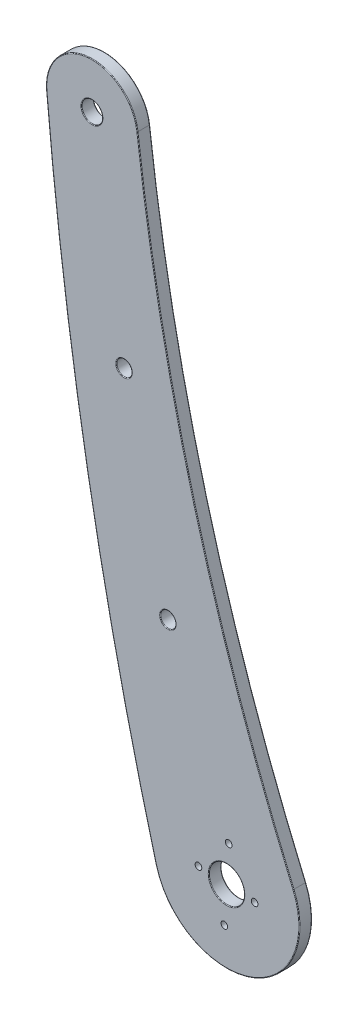
ISO-10303-21;
HEADER;
FILE_DESCRIPTION(('STEP AP214'),'2;1');
FILE_NAME('part.step','',(''),(''),'','','');
FILE_SCHEMA(('AUTOMOTIVE_DESIGN { 1 0 10303 214 1 1 1 1 }'));
ENDSEC;
DATA;
#1=APPLICATION_CONTEXT('core data for automotive mechanical design processes');
#2=APPLICATION_PROTOCOL_DEFINITION('international standard','automotive_design',2000,#1);
#3=PRODUCT_CONTEXT('',#1,'mechanical');
#4=PRODUCT('Part','Part','',(#3));
#5=PRODUCT_RELATED_PRODUCT_CATEGORY('part','',(#4));
#6=PRODUCT_DEFINITION_FORMATION('','',#4);
#7=PRODUCT_DEFINITION_CONTEXT('part definition',#1,'design');
#8=PRODUCT_DEFINITION('design','',#6,#7);
#9=PRODUCT_DEFINITION_SHAPE('','',#8);
#10=(LENGTH_UNIT() NAMED_UNIT(*) SI_UNIT(.MILLI.,.METRE.));
#11=(NAMED_UNIT(*) PLANE_ANGLE_UNIT() SI_UNIT($,.RADIAN.));
#12=(NAMED_UNIT(*) SI_UNIT($,.STERADIAN.) SOLID_ANGLE_UNIT());
#13=UNCERTAINTY_MEASURE_WITH_UNIT(LENGTH_MEASURE(1.E-05),#10,'distance_accuracy_value','');
#14=(GEOMETRIC_REPRESENTATION_CONTEXT(3) GLOBAL_UNCERTAINTY_ASSIGNED_CONTEXT((#13)) GLOBAL_UNIT_ASSIGNED_CONTEXT((#10,
#11,#12)) REPRESENTATION_CONTEXT('',''));
#15=CARTESIAN_POINT('',(0.,0.,0.));
#16=DIRECTION('',(0.,0.,1.));
#17=DIRECTION('',(1.,0.,0.));
#18=AXIS2_PLACEMENT_3D('',#15,#16,#17);
#19=CARTESIAN_POINT('',(-52.5326704764156,202.00953759165,-3.));
#20=DIRECTION('',(0.,0.,1.));
#21=DIRECTION('',(1.,0.,0.));
#22=AXIS2_PLACEMENT_3D('',#19,#20,#21);
#23=CYLINDRICAL_SURFACE('',#22,11.);
#24=DIRECTION('',(0.,0.,1.));
#25=VECTOR('',#24,1.);
#26=CARTESIAN_POINT('',(-63.4903311638689,201.045342456505,-3.));
#27=LINE('',#26,#25);
#28=CARTESIAN_POINT('',(-63.4903311638689,201.045342456505,-2.85));
#29=VERTEX_POINT('',#28);
#30=CARTESIAN_POINT('',(-63.4903311638689,201.045342456505,-0.15));
#31=VERTEX_POINT('',#30);
#32=EDGE_CURVE('E191',#29,#31,#27,.T.);
#33=ORIENTED_EDGE('',*,*,#32,.T.);
#34=CARTESIAN_POINT('',(-52.5326704764156,202.00953759165,-0.15));
#35=DIRECTION('',(0.,0.,-1.));
#36=DIRECTION('',(-1.,0.,0.));
#37=AXIS2_PLACEMENT_3D('',#34,#35,#36);
#38=CIRCLE('',#37,11.);
#39=CARTESIAN_POINT('',(-41.6108764018388,203.318893995591,-0.15));
#40=VERTEX_POINT('',#39);
#41=EDGE_CURVE('E144',#31,#40,#38,.T.);
#42=ORIENTED_EDGE('',*,*,#41,.T.);
#43=DIRECTION('',(0.,0.,1.));
#44=VECTOR('',#43,1.);
#45=CARTESIAN_POINT('',(-41.6108764018388,203.318893995591,-3.));
#46=LINE('',#45,#44);
#47=CARTESIAN_POINT('',(-41.6108764018388,203.318893995591,-2.85));
#48=VERTEX_POINT('',#47);
#49=EDGE_CURVE('E344',#48,#40,#46,.T.);
#50=ORIENTED_EDGE('',*,*,#49,.F.);
#51=CARTESIAN_POINT('',(-52.5326704764156,202.00953759165,-2.85));
#52=DIRECTION('',(0.,0.,-1.));
#53=DIRECTION('',(-1.,0.,0.));
#54=AXIS2_PLACEMENT_3D('',#51,#52,#53);
#55=CIRCLE('',#54,11.);
#56=EDGE_CURVE('E142',#48,#29,#55,.F.);
#57=ORIENTED_EDGE('',*,*,#56,.T.);
#58=EDGE_LOOP('',(#33,#42,#50,#57));
#59=FACE_BOUND('',#58,.T.);
#60=ADVANCED_FACE('F33',(#59),#23,.T.);
#61=CARTESIAN_POINT('',(454.834308806195,262.835094174707,-3.));
#62=DIRECTION('',(0.,0.,1.));
#63=DIRECTION('',(1.,0.,0.));
#64=AXIS2_PLACEMENT_3D('',#61,#62,#63);
#65=CYLINDRICAL_SURFACE('',#64,500.);
#66=ORIENTED_EDGE('',*,*,#49,.T.);
#67=CARTESIAN_POINT('',(454.834308806195,262.835094174707,-0.15));
#68=DIRECTION('',(0.,0.,-1.));
#69=DIRECTION('',(-1.,0.,0.));
#70=AXIS2_PLACEMENT_3D('',#67,#68,#69);
#71=CIRCLE('',#70,500.);
#72=CARTESIAN_POINT('',(-4.15536153795476,64.5209935228163,-0.15));
#73=VERTEX_POINT('',#72);
#74=EDGE_CURVE('E105',#40,#73,#71,.F.);
#75=ORIENTED_EDGE('',*,*,#74,.T.);
#76=DIRECTION('',(0.,0.,1.));
#77=VECTOR('',#76,1.);
#78=CARTESIAN_POINT('',(-4.15536153795476,64.5209935228163,-3.));
#79=LINE('',#78,#77);
#80=CARTESIAN_POINT('',(-4.15536153795476,64.5209935228163,-2.85));
#81=VERTEX_POINT('',#80);
#82=EDGE_CURVE('E338',#81,#73,#79,.T.);
#83=ORIENTED_EDGE('',*,*,#82,.F.);
#84=CARTESIAN_POINT('',(454.834308806195,262.835094174707,-2.85));
#85=DIRECTION('',(0.,0.,-1.));
#86=DIRECTION('',(-1.,0.,0.));
#87=AXIS2_PLACEMENT_3D('',#84,#85,#86);
#88=CIRCLE('',#87,500.);
#89=EDGE_CURVE('E126',#81,#48,#88,.T.);
#90=ORIENTED_EDGE('',*,*,#89,.T.);
#91=EDGE_LOOP('',(#66,#75,#83,#90));
#92=FACE_BOUND('',#91,.T.);
#93=ADVANCED_FACE('F228',(#92),#65,.F.);
#94=CARTESIAN_POINT('',(-20.22,57.58,-3.));
#95=DIRECTION('',(0.,0.,1.));
#96=DIRECTION('',(1.,0.,0.));
#97=AXIS2_PLACEMENT_3D('',#94,#95,#96);
#98=CYLINDRICAL_SURFACE('',#97,17.4999999999999);
#99=ORIENTED_EDGE('',*,*,#82,.T.);
#100=CARTESIAN_POINT('',(-20.22,57.58,-0.15));
#101=DIRECTION('',(0.,0.,-1.));
#102=DIRECTION('',(-1.,0.,0.));
#103=AXIS2_PLACEMENT_3D('',#100,#101,#102);
#104=CIRCLE('',#103,17.4999999999999);
#105=CARTESIAN_POINT('',(-37.1095073957766,52.9980200864687,-0.15));
#106=VERTEX_POINT('',#105);
#107=EDGE_CURVE('E135',#73,#106,#104,.T.);
#108=ORIENTED_EDGE('',*,*,#107,.T.);
#109=DIRECTION('',(0.,0.,1.));
#110=VECTOR('',#109,1.);
#111=CARTESIAN_POINT('',(-37.1095073957766,52.9980200864687,-3.));
#112=LINE('',#111,#110);
#113=CARTESIAN_POINT('',(-37.1095073957766,52.9980200864687,-2.85));
#114=VERTEX_POINT('',#113);
#115=EDGE_CURVE('E345',#114,#106,#112,.T.);
#116=ORIENTED_EDGE('',*,*,#115,.F.);
#117=CARTESIAN_POINT('',(-20.22,57.58,-2.85));
#118=DIRECTION('',(0.,0.,-1.));
#119=DIRECTION('',(-1.,0.,0.));
#120=AXIS2_PLACEMENT_3D('',#117,#118,#119);
#121=CIRCLE('',#120,17.4999999999999);
#122=EDGE_CURVE('E133',#114,#81,#121,.F.);
#123=ORIENTED_EDGE('',*,*,#122,.T.);
#124=EDGE_LOOP('',(#99,#108,#116,#123));
#125=FACE_BOUND('',#124,.T.);
#126=ADVANCED_FACE('F234',(#125),#98,.T.);
#127=CARTESIAN_POINT('',(783.237994684804,275.551330172281,-3.));
#128=DIRECTION('',(0.,0.,1.));
#129=DIRECTION('',(1.,0.,0.));
#130=AXIS2_PLACEMENT_3D('',#127,#128,#129);
#131=CYLINDRICAL_SURFACE('',#130,850.);
#132=ORIENTED_EDGE('',*,*,#115,.T.);
#133=CARTESIAN_POINT('',(783.237994684804,275.551330172281,-0.15));
#134=DIRECTION('',(0.,0.,-1.));
#135=DIRECTION('',(-1.,0.,0.));
#136=AXIS2_PLACEMENT_3D('',#133,#134,#135);
#137=CIRCLE('',#136,850.);
#138=EDGE_CURVE('E140',#106,#31,#137,.T.);
#139=ORIENTED_EDGE('',*,*,#138,.T.);
#140=ORIENTED_EDGE('',*,*,#32,.F.);
#141=CARTESIAN_POINT('',(783.237994684804,275.551330172281,-2.85));
#142=DIRECTION('',(0.,0.,-1.));
#143=DIRECTION('',(-1.,0.,0.));
#144=AXIS2_PLACEMENT_3D('',#141,#142,#143);
#145=CIRCLE('',#144,850.);
#146=EDGE_CURVE('E137',#29,#114,#145,.F.);
#147=ORIENTED_EDGE('',*,*,#146,.T.);
#148=EDGE_LOOP('',(#132,#139,#140,#147));
#149=FACE_BOUND('',#148,.T.);
#150=ADVANCED_FACE('F240',(#149),#131,.T.);
#151=CARTESIAN_POINT('',(201.15081916489,232.422315883179,-3.));
#152=DIRECTION('',(0.,0.,-1.));
#153=DIRECTION('',(-1.,0.,0.));
#154=AXIS2_PLACEMENT_3D('',#151,#152,#153);
#155=PLANE('',#154);
#156=CARTESIAN_POINT('',(-26.9578565541103,57.9847086064185,-3.));
#157=DIRECTION('',(0.,0.,-1.));
#158=DIRECTION('',(-1.,0.,0.));
#159=AXIS2_PLACEMENT_3D('',#156,#157,#158);
#160=CIRCLE('',#159,0.799999999990664);
#161=CARTESIAN_POINT('',(-27.7578565541009,57.9847086064185,-3.));
#162=VERTEX_POINT('',#161);
#163=EDGE_CURVE('E205',#162,#162,#160,.T.);
#164=ORIENTED_EDGE('',*,*,#163,.F.);
#165=EDGE_LOOP('',(#164));
#166=FACE_BOUND('',#165,.T.);
#167=CARTESIAN_POINT('',(-20.7446222675799,48.8457415039233,-3.));
#168=DIRECTION('',(0.,0.,-1.));
#169=DIRECTION('',(-1.,0.,0.));
#170=AXIS2_PLACEMENT_3D('',#167,#168,#169);
#171=CIRCLE('',#170,0.800000000000003);
#172=CARTESIAN_POINT('',(-21.5446222675799,48.8457415039233,-3.));
#173=VERTEX_POINT('',#172);
#174=EDGE_CURVE('E408',#173,#173,#171,.T.);
#175=ORIENTED_EDGE('',*,*,#174,.F.);
#176=EDGE_LOOP('',(#175));
#177=FACE_BOUND('',#176,.T.);
#178=CARTESIAN_POINT('',(-13.4821434458898,57.1752913935817,-3.));
#179=DIRECTION('',(0.,0.,-1.));
#180=DIRECTION('',(1.,0.,0.));
#181=AXIS2_PLACEMENT_3D('',#178,#179,#180);
#182=CIRCLE('',#181,0.799999999990663);
#183=CARTESIAN_POINT('',(-12.6821434458991,57.1752913935817,-3.));
#184=VERTEX_POINT('',#183);
#185=EDGE_CURVE('E405',#184,#184,#182,.T.);
#186=ORIENTED_EDGE('',*,*,#185,.F.);
#187=EDGE_LOOP('',(#186));
#188=FACE_BOUND('',#187,.T.);
#189=CARTESIAN_POINT('',(-19.6953777324201,66.3142584960768,-3.));
#190=DIRECTION('',(0.,0.,-1.));
#191=DIRECTION('',(1.,0.,0.));
#192=AXIS2_PLACEMENT_3D('',#189,#190,#191);
#193=CIRCLE('',#192,0.800000000000005);
#194=CARTESIAN_POINT('',(-18.8953777324201,66.3142584960768,-3.));
#195=VERTEX_POINT('',#194);
#196=EDGE_CURVE('E402',#195,#195,#193,.T.);
#197=ORIENTED_EDGE('',*,*,#196,.F.);
#198=EDGE_LOOP('',(#197));
#199=FACE_BOUND('',#198,.T.);
#200=CARTESIAN_POINT('',(-20.22,57.58,-3.));
#201=DIRECTION('',(0.,0.,-1.));
#202=DIRECTION('',(-1.,0.,0.));
#203=AXIS2_PLACEMENT_3D('',#200,#201,#202);
#204=CIRCLE('',#203,17.3499999999999);
#205=CARTESIAN_POINT('',(-4.29305843905803,64.4614992926207,-3.));
#206=VERTEX_POINT('',#205);
#207=CARTESIAN_POINT('',(-36.9647401895271,53.0372942000132,-3.));
#208=VERTEX_POINT('',#207);
#209=EDGE_CURVE('E42',#206,#208,#204,.T.);
#210=ORIENTED_EDGE('',*,*,#209,.T.);
#211=CARTESIAN_POINT('',(783.237994684804,275.551330172281,-3.));
#212=DIRECTION('',(0.,0.,-1.));
#213=DIRECTION('',(-1.,0.,0.));
#214=AXIS2_PLACEMENT_3D('',#211,#212,#213);
#215=CIRCLE('',#214,849.85);
#216=CARTESIAN_POINT('',(-63.340908518131,201.058490571985,-3.));
#217=VERTEX_POINT('',#216);
#218=EDGE_CURVE('E11',#208,#217,#215,.T.);
#219=ORIENTED_EDGE('',*,*,#218,.T.);
#220=CARTESIAN_POINT('',(-52.5326704764156,202.00953759165,-3.));
#221=DIRECTION('',(0.,0.,-1.));
#222=DIRECTION('',(-1.,0.,0.));
#223=AXIS2_PLACEMENT_3D('',#220,#221,#222);
#224=CIRCLE('',#223,10.85);
#225=CARTESIAN_POINT('',(-41.7598099574013,203.301039135537,-3.));
#226=VERTEX_POINT('',#225);
#227=EDGE_CURVE('E182',#217,#226,#224,.T.);
#228=ORIENTED_EDGE('',*,*,#227,.T.);
#229=CARTESIAN_POINT('',(454.834308806195,262.835094174707,-3.));
#230=DIRECTION('',(0.,0.,-1.));
#231=DIRECTION('',(-1.,0.,0.));
#232=AXIS2_PLACEMENT_3D('',#229,#230,#231);
#233=CIRCLE('',#232,500.15);
#234=EDGE_CURVE('E53',#226,#206,#233,.F.);
#235=ORIENTED_EDGE('',*,*,#234,.T.);
#236=EDGE_LOOP('',(#210,#219,#228,#235));
#237=FACE_BOUND('',#236,.T.);
#238=CARTESIAN_POINT('',(-52.5326704764156,202.00953759165,-3.));
#239=DIRECTION('',(0.,0.,-1.));
#240=DIRECTION('',(-1.,0.,0.));
#241=AXIS2_PLACEMENT_3D('',#238,#239,#240);
#242=CIRCLE('',#241,2.65);
#243=CARTESIAN_POINT('',(-55.1826704764156,202.00953759165,-3.));
#244=VERTEX_POINT('',#243);
#245=EDGE_CURVE('E179',#244,#244,#242,.F.);
#246=ORIENTED_EDGE('',*,*,#245,.T.);
#247=EDGE_LOOP('',(#246));
#248=FACE_BOUND('',#247,.T.);
#249=CARTESIAN_POINT('',(-20.22,57.5800000000001,-3.));
#250=DIRECTION('',(0.,0.,-1.));
#251=DIRECTION('',(-1.,0.,0.));
#252=AXIS2_PLACEMENT_3D('',#249,#250,#251);
#253=CIRCLE('',#252,4.4);
#254=CARTESIAN_POINT('',(-24.62,57.5800000000001,-3.));
#255=VERTEX_POINT('',#254);
#256=EDGE_CURVE('E176',#255,#255,#253,.F.);
#257=ORIENTED_EDGE('',*,*,#256,.T.);
#258=EDGE_LOOP('',(#257));
#259=FACE_BOUND('',#258,.T.);
#260=CARTESIAN_POINT('',(-34.3061626122095,105.554785282088,-3.));
#261=DIRECTION('',(0.,0.,-1.));
#262=DIRECTION('',(-1.,0.,0.));
#263=AXIS2_PLACEMENT_3D('',#260,#261,#262);
#264=CIRCLE('',#263,1.99999999999999);
#265=CARTESIAN_POINT('',(-36.3061626122095,105.554785282088,-3.));
#266=VERTEX_POINT('',#265);
#267=EDGE_CURVE('E173',#266,#266,#264,.F.);
#268=ORIENTED_EDGE('',*,*,#267,.T.);
#269=EDGE_LOOP('',(#268));
#270=FACE_BOUND('',#269,.T.);
#271=CARTESIAN_POINT('',(-44.8327479429161,152.605983134728,-3.));
#272=DIRECTION('',(0.,0.,-1.));
#273=DIRECTION('',(-1.,0.,0.));
#274=AXIS2_PLACEMENT_3D('',#271,#272,#273);
#275=CIRCLE('',#274,1.99999999999999);
#276=CARTESIAN_POINT('',(-46.8327479429161,152.605983134728,-3.));
#277=VERTEX_POINT('',#276);
#278=EDGE_CURVE('E170',#277,#277,#275,.F.);
#279=ORIENTED_EDGE('',*,*,#278,.T.);
#280=EDGE_LOOP('',(#279));
#281=FACE_BOUND('',#280,.T.);
#282=ADVANCED_FACE('F325',(#166,#177,#188,#199,#237,#248,#259,#270,#281),#155,.T.);
#283=CARTESIAN_POINT('',(201.15081916489,232.422315883179,0.));
#284=DIRECTION('',(0.,0.,-1.));
#285=DIRECTION('',(-1.,0.,0.));
#286=AXIS2_PLACEMENT_3D('',#283,#284,#285);
#287=PLANE('',#286);
#288=CARTESIAN_POINT('',(-26.9578565541103,57.9847086064185,0.));
#289=DIRECTION('',(0.,0.,-1.));
#290=DIRECTION('',(-1.,0.,0.));
#291=AXIS2_PLACEMENT_3D('',#288,#289,#290);
#292=CIRCLE('',#291,0.799999999990664);
#293=CARTESIAN_POINT('',(-27.7578565541009,57.9847086064185,0.));
#294=VERTEX_POINT('',#293);
#295=EDGE_CURVE('E37',#294,#294,#292,.T.);
#296=ORIENTED_EDGE('',*,*,#295,.T.);
#297=EDGE_LOOP('',(#296));
#298=FACE_BOUND('',#297,.T.);
#299=CARTESIAN_POINT('',(-20.7446222675799,48.8457415039233,0.));
#300=DIRECTION('',(0.,0.,-1.));
#301=DIRECTION('',(-1.,0.,0.));
#302=AXIS2_PLACEMENT_3D('',#299,#300,#301);
#303=CIRCLE('',#302,0.800000000000003);
#304=CARTESIAN_POINT('',(-21.5446222675799,48.8457415039233,0.));
#305=VERTEX_POINT('',#304);
#306=EDGE_CURVE('E207',#305,#305,#303,.T.);
#307=ORIENTED_EDGE('',*,*,#306,.T.);
#308=EDGE_LOOP('',(#307));
#309=FACE_BOUND('',#308,.T.);
#310=CARTESIAN_POINT('',(-13.4821434458898,57.1752913935817,0.));
#311=DIRECTION('',(0.,0.,-1.));
#312=DIRECTION('',(-1.,0.,0.));
#313=AXIS2_PLACEMENT_3D('',#310,#311,#312);
#314=CIRCLE('',#313,0.799999999990663);
#315=CARTESIAN_POINT('',(-14.2821434458804,57.1752913935817,0.));
#316=VERTEX_POINT('',#315);
#317=EDGE_CURVE('E204',#316,#316,#314,.T.);
#318=ORIENTED_EDGE('',*,*,#317,.T.);
#319=EDGE_LOOP('',(#318));
#320=FACE_BOUND('',#319,.T.);
#321=CARTESIAN_POINT('',(-19.6953777324201,66.3142584960768,0.));
#322=DIRECTION('',(0.,0.,-1.));
#323=DIRECTION('',(-1.,0.,0.));
#324=AXIS2_PLACEMENT_3D('',#321,#322,#323);
#325=CIRCLE('',#324,0.800000000000005);
#326=CARTESIAN_POINT('',(-20.4953777324201,66.3142584960768,0.));
#327=VERTEX_POINT('',#326);
#328=EDGE_CURVE('E201',#327,#327,#325,.T.);
#329=ORIENTED_EDGE('',*,*,#328,.T.);
#330=EDGE_LOOP('',(#329));
#331=FACE_BOUND('',#330,.T.);
#332=CARTESIAN_POINT('',(-20.22,57.58,0.));
#333=DIRECTION('',(0.,0.,-1.));
#334=DIRECTION('',(-1.,0.,0.));
#335=AXIS2_PLACEMENT_3D('',#332,#333,#334);
#336=CIRCLE('',#335,17.3499999999999);
#337=CARTESIAN_POINT('',(-36.964740189527,53.0372942000132,0.));
#338=VERTEX_POINT('',#337);
#339=CARTESIAN_POINT('',(-4.29305843905814,64.4614992926207,0.));
#340=VERTEX_POINT('',#339);
#341=EDGE_CURVE('E124',#338,#340,#336,.F.);
#342=ORIENTED_EDGE('',*,*,#341,.T.);
#343=CARTESIAN_POINT('',(454.834308806195,262.835094174707,0.));
#344=DIRECTION('',(0.,0.,-1.));
#345=DIRECTION('',(-1.,0.,0.));
#346=AXIS2_PLACEMENT_3D('',#343,#344,#345);
#347=CIRCLE('',#346,500.15);
#348=CARTESIAN_POINT('',(-41.7598099574013,203.301039135537,0.));
#349=VERTEX_POINT('',#348);
#350=EDGE_CURVE('E103',#340,#349,#347,.T.);
#351=ORIENTED_EDGE('',*,*,#350,.T.);
#352=CARTESIAN_POINT('',(-52.5326704764156,202.00953759165,0.));
#353=DIRECTION('',(0.,0.,-1.));
#354=DIRECTION('',(-1.,0.,0.));
#355=AXIS2_PLACEMENT_3D('',#352,#353,#354);
#356=CIRCLE('',#355,10.85);
#357=CARTESIAN_POINT('',(-63.340908518131,201.058490571985,0.));
#358=VERTEX_POINT('',#357);
#359=EDGE_CURVE('E112',#349,#358,#356,.F.);
#360=ORIENTED_EDGE('',*,*,#359,.T.);
#361=CARTESIAN_POINT('',(783.237994684804,275.551330172281,0.));
#362=DIRECTION('',(0.,0.,-1.));
#363=DIRECTION('',(-1.,0.,0.));
#364=AXIS2_PLACEMENT_3D('',#361,#362,#363);
#365=CIRCLE('',#364,849.85);
#366=EDGE_CURVE('E118',#358,#338,#365,.F.);
#367=ORIENTED_EDGE('',*,*,#366,.T.);
#368=EDGE_LOOP('',(#342,#351,#360,#367));
#369=FACE_BOUND('',#368,.T.);
#370=CARTESIAN_POINT('',(-52.5326704764156,202.00953759165,0.));
#371=DIRECTION('',(0.,0.,-1.));
#372=DIRECTION('',(-1.,0.,0.));
#373=AXIS2_PLACEMENT_3D('',#370,#371,#372);
#374=CIRCLE('',#373,2.65);
#375=CARTESIAN_POINT('',(-55.1826704764156,202.00953759165,0.));
#376=VERTEX_POINT('',#375);
#377=EDGE_CURVE('E119',#376,#376,#374,.T.);
#378=ORIENTED_EDGE('',*,*,#377,.T.);
#379=EDGE_LOOP('',(#378));
#380=FACE_BOUND('',#379,.T.);
#381=CARTESIAN_POINT('',(-20.22,57.5800000000001,0.));
#382=DIRECTION('',(0.,0.,-1.));
#383=DIRECTION('',(-1.,0.,0.));
#384=AXIS2_PLACEMENT_3D('',#381,#382,#383);
#385=CIRCLE('',#384,4.4);
#386=CARTESIAN_POINT('',(-24.62,57.5800000000001,0.));
#387=VERTEX_POINT('',#386);
#388=EDGE_CURVE('E359',#387,#387,#385,.T.);
#389=ORIENTED_EDGE('',*,*,#388,.T.);
#390=EDGE_LOOP('',(#389));
#391=FACE_BOUND('',#390,.T.);
#392=CARTESIAN_POINT('',(-34.3061626122095,105.554785282088,0.));
#393=DIRECTION('',(0.,0.,-1.));
#394=DIRECTION('',(-1.,0.,0.));
#395=AXIS2_PLACEMENT_3D('',#392,#393,#394);
#396=CIRCLE('',#395,1.99999999999999);
#397=CARTESIAN_POINT('',(-36.3061626122095,105.554785282088,0.));
#398=VERTEX_POINT('',#397);
#399=EDGE_CURVE('E356',#398,#398,#396,.T.);
#400=ORIENTED_EDGE('',*,*,#399,.T.);
#401=EDGE_LOOP('',(#400));
#402=FACE_BOUND('',#401,.T.);
#403=CARTESIAN_POINT('',(-44.8327479429161,152.605983134728,0.));
#404=DIRECTION('',(0.,0.,-1.));
#405=DIRECTION('',(-1.,0.,0.));
#406=AXIS2_PLACEMENT_3D('',#403,#404,#405);
#407=CIRCLE('',#406,1.99999999999999);
#408=CARTESIAN_POINT('',(-46.8327479429161,152.605983134728,0.));
#409=VERTEX_POINT('',#408);
#410=EDGE_CURVE('E348',#409,#409,#407,.T.);
#411=ORIENTED_EDGE('',*,*,#410,.T.);
#412=EDGE_LOOP('',(#411));
#413=FACE_BOUND('',#412,.T.);
#414=ADVANCED_FACE('F121',(#298,#309,#320,#331,#369,#380,#391,#402,#413),#287,.F.);
#415=CARTESIAN_POINT('',(-52.5326704764156,202.00953759165,-3.));
#416=DIRECTION('',(0.,0.,1.));
#417=DIRECTION('',(1.,0.,0.));
#418=AXIS2_PLACEMENT_3D('',#415,#416,#417);
#419=CYLINDRICAL_SURFACE('',#418,2.5);
#420=CARTESIAN_POINT('',(-52.5326704764156,202.00953759165,-0.15));
#421=DIRECTION('',(0.,0.,-1.));
#422=DIRECTION('',(-1.,0.,0.));
#423=AXIS2_PLACEMENT_3D('',#420,#421,#422);
#424=CIRCLE('',#423,2.5);
#425=CARTESIAN_POINT('',(-55.0326704764156,202.00953759165,-0.15));
#426=VERTEX_POINT('',#425);
#427=EDGE_CURVE('E149',#426,#426,#424,.F.);
#428=ORIENTED_EDGE('',*,*,#427,.T.);
#429=EDGE_LOOP('',(#428));
#430=FACE_BOUND('',#429,.T.);
#431=CARTESIAN_POINT('',(-52.5326704764156,202.00953759165,-2.85));
#432=DIRECTION('',(0.,0.,-1.));
#433=DIRECTION('',(-1.,0.,0.));
#434=AXIS2_PLACEMENT_3D('',#431,#432,#433);
#435=CIRCLE('',#434,2.5);
#436=CARTESIAN_POINT('',(-55.0326704764156,202.00953759165,-2.85));
#437=VERTEX_POINT('',#436);
#438=EDGE_CURVE('E146',#437,#437,#435,.T.);
#439=ORIENTED_EDGE('',*,*,#438,.T.);
#440=EDGE_LOOP('',(#439));
#441=FACE_BOUND('',#440,.T.);
#442=ADVANCED_FACE('F317',(#430,#441),#419,.F.);
#443=CARTESIAN_POINT('',(-20.22,57.5800000000001,-3.));
#444=DIRECTION('',(0.,0.,1.));
#445=DIRECTION('',(1.,0.,0.));
#446=AXIS2_PLACEMENT_3D('',#443,#444,#445);
#447=CYLINDRICAL_SURFACE('',#446,4.25);
#448=CARTESIAN_POINT('',(-20.22,57.5800000000001,-0.15));
#449=DIRECTION('',(0.,0.,-1.));
#450=DIRECTION('',(-1.,0.,0.));
#451=AXIS2_PLACEMENT_3D('',#448,#449,#450);
#452=CIRCLE('',#451,4.25);
#453=CARTESIAN_POINT('',(-24.47,57.5800000000001,-0.15));
#454=VERTEX_POINT('',#453);
#455=EDGE_CURVE('E155',#454,#454,#452,.F.);
#456=ORIENTED_EDGE('',*,*,#455,.T.);
#457=EDGE_LOOP('',(#456));
#458=FACE_BOUND('',#457,.T.);
#459=CARTESIAN_POINT('',(-20.22,57.5800000000001,-2.85));
#460=DIRECTION('',(0.,0.,-1.));
#461=DIRECTION('',(-1.,0.,0.));
#462=AXIS2_PLACEMENT_3D('',#459,#460,#461);
#463=CIRCLE('',#462,4.25);
#464=CARTESIAN_POINT('',(-24.47,57.5800000000001,-2.85));
#465=VERTEX_POINT('',#464);
#466=EDGE_CURVE('E152',#465,#465,#463,.T.);
#467=ORIENTED_EDGE('',*,*,#466,.T.);
#468=EDGE_LOOP('',(#467));
#469=FACE_BOUND('',#468,.T.);
#470=ADVANCED_FACE('F308',(#458,#469),#447,.F.);
#471=CARTESIAN_POINT('',(-34.3061626122095,105.554785282088,-3.));
#472=DIRECTION('',(0.,0.,-1.));
#473=DIRECTION('',(-1.,0.,0.));
#474=AXIS2_PLACEMENT_3D('',#471,#472,#473);
#475=CYLINDRICAL_SURFACE('',#474,1.84999999999999);
#476=CARTESIAN_POINT('',(-34.3061626122095,105.554785282088,-0.15));
#477=DIRECTION('',(0.,0.,-1.));
#478=DIRECTION('',(-1.,0.,0.));
#479=AXIS2_PLACEMENT_3D('',#476,#477,#478);
#480=CIRCLE('',#479,1.84999999999999);
#481=CARTESIAN_POINT('',(-36.1561626122095,105.554785282088,-0.15));
#482=VERTEX_POINT('',#481);
#483=EDGE_CURVE('E161',#482,#482,#480,.F.);
#484=ORIENTED_EDGE('',*,*,#483,.T.);
#485=EDGE_LOOP('',(#484));
#486=FACE_BOUND('',#485,.T.);
#487=CARTESIAN_POINT('',(-34.3061626122095,105.554785282088,-2.85));
#488=DIRECTION('',(0.,0.,-1.));
#489=DIRECTION('',(-1.,0.,0.));
#490=AXIS2_PLACEMENT_3D('',#487,#488,#489);
#491=CIRCLE('',#490,1.84999999999999);
#492=CARTESIAN_POINT('',(-36.1561626122095,105.554785282088,-2.85));
#493=VERTEX_POINT('',#492);
#494=EDGE_CURVE('E158',#493,#493,#491,.T.);
#495=ORIENTED_EDGE('',*,*,#494,.T.);
#496=EDGE_LOOP('',(#495));
#497=FACE_BOUND('',#496,.T.);
#498=ADVANCED_FACE('F306',(#486,#497),#475,.F.);
#499=CARTESIAN_POINT('',(-44.8327479429161,152.605983134728,-3.));
#500=DIRECTION('',(0.,0.,-1.));
#501=DIRECTION('',(-1.,0.,0.));
#502=AXIS2_PLACEMENT_3D('',#499,#500,#501);
#503=CYLINDRICAL_SURFACE('',#502,1.84999999999999);
#504=CARTESIAN_POINT('',(-44.8327479429161,152.605983134728,-0.15));
#505=DIRECTION('',(0.,0.,-1.));
#506=DIRECTION('',(-1.,0.,0.));
#507=AXIS2_PLACEMENT_3D('',#504,#505,#506);
#508=CIRCLE('',#507,1.84999999999999);
#509=CARTESIAN_POINT('',(-46.6827479429161,152.605983134728,-0.15));
#510=VERTEX_POINT('',#509);
#511=EDGE_CURVE('E167',#510,#510,#508,.F.);
#512=ORIENTED_EDGE('',*,*,#511,.T.);
#513=EDGE_LOOP('',(#512));
#514=FACE_BOUND('',#513,.T.);
#515=CARTESIAN_POINT('',(-44.8327479429161,152.605983134728,-2.85));
#516=DIRECTION('',(0.,0.,-1.));
#517=DIRECTION('',(-1.,0.,0.));
#518=AXIS2_PLACEMENT_3D('',#515,#516,#517);
#519=CIRCLE('',#518,1.84999999999999);
#520=CARTESIAN_POINT('',(-46.6827479429161,152.605983134728,-2.85));
#521=VERTEX_POINT('',#520);
#522=EDGE_CURVE('E164',#521,#521,#519,.T.);
#523=ORIENTED_EDGE('',*,*,#522,.T.);
#524=EDGE_LOOP('',(#523));
#525=FACE_BOUND('',#524,.T.);
#526=ADVANCED_FACE('F254',(#514,#525),#503,.F.);
#527=CARTESIAN_POINT('',(783.237994684804,275.551330172281,-0.15));
#528=DIRECTION('',(0.,0.,-1.));
#529=DIRECTION('',(-1.,0.,0.));
#530=AXIS2_PLACEMENT_3D('',#527,#528,#529);
#531=TOROIDAL_SURFACE('',#530,849.85,0.15);
#532=CARTESIAN_POINT('',(-63.3409085181309,201.058490571985,-0.15));
#533=DIRECTION('',(-0.0876541031950377,0.996150971586674,0.));
#534=DIRECTION('',(-0.996150971586674,-0.0876541031950377,0.));
#535=AXIS2_PLACEMENT_3D('',#532,#533,#534);
#536=CIRCLE('',#535,0.15);
#537=EDGE_CURVE('E115',#31,#358,#536,.T.);
#538=ORIENTED_EDGE('',*,*,#537,.F.);
#539=ORIENTED_EDGE('',*,*,#138,.F.);
#540=CARTESIAN_POINT('',(-36.964740189527,53.0372942000132,-0.15));
#541=DIRECTION('',(0.261827423630364,-0.965114708330096,0.));
#542=DIRECTION('',(0.965114708330096,0.261827423630364,0.));
#543=AXIS2_PLACEMENT_3D('',#540,#541,#542);
#544=CIRCLE('',#543,0.15);
#545=EDGE_CURVE('E188',#338,#106,#544,.T.);
#546=ORIENTED_EDGE('',*,*,#545,.F.);
#547=ORIENTED_EDGE('',*,*,#366,.F.);
#548=EDGE_LOOP('',(#538,#539,#546,#547));
#549=FACE_BOUND('',#548,.T.);
#550=ADVANCED_FACE('F250',(#549),#531,.T.);
#551=CARTESIAN_POINT('',(-20.22,57.58,-0.15));
#552=DIRECTION('',(0.,0.,-1.));
#553=DIRECTION('',(-1.,0.,0.));
#554=AXIS2_PLACEMENT_3D('',#551,#552,#553);
#555=TOROIDAL_SURFACE('',#554,17.3499999999999,0.15);
#556=ORIENTED_EDGE('',*,*,#545,.T.);
#557=ORIENTED_EDGE('',*,*,#107,.F.);
#558=CARTESIAN_POINT('',(-4.29305843905814,64.4614992926207,-0.15));
#559=DIRECTION('',(-0.396628201303757,0.917979340688311,0.));
#560=DIRECTION('',(-0.917979340688311,-0.396628201303757,0.));
#561=AXIS2_PLACEMENT_3D('',#558,#559,#560);
#562=CIRCLE('',#561,0.15);
#563=EDGE_CURVE('E108',#340,#73,#562,.T.);
#564=ORIENTED_EDGE('',*,*,#563,.F.);
#565=ORIENTED_EDGE('',*,*,#341,.F.);
#566=EDGE_LOOP('',(#556,#557,#564,#565));
#567=FACE_BOUND('',#566,.T.);
#568=ADVANCED_FACE('F247',(#567),#555,.T.);
#569=CARTESIAN_POINT('',(-52.5326704764156,202.00953759165,-0.15));
#570=DIRECTION('',(0.,0.,-1.));
#571=DIRECTION('',(-1.,0.,0.));
#572=AXIS2_PLACEMENT_3D('',#569,#570,#571);
#573=TOROIDAL_SURFACE('',#572,10.85,0.15);
#574=ORIENTED_EDGE('',*,*,#537,.T.);
#575=ORIENTED_EDGE('',*,*,#359,.F.);
#576=CARTESIAN_POINT('',(-41.7598099574013,203.301039135537,-0.15));
#577=DIRECTION('',(0.119032400358227,-0.992890370416069,0.));
#578=DIRECTION('',(0.992890370416069,0.119032400358227,0.));
#579=AXIS2_PLACEMENT_3D('',#576,#577,#578);
#580=CIRCLE('',#579,0.15);
#581=EDGE_CURVE('E99',#40,#349,#580,.T.);
#582=ORIENTED_EDGE('',*,*,#581,.F.);
#583=ORIENTED_EDGE('',*,*,#41,.F.);
#584=EDGE_LOOP('',(#574,#575,#582,#583));
#585=FACE_BOUND('',#584,.T.);
#586=ADVANCED_FACE('F113',(#585),#573,.T.);
#587=CARTESIAN_POINT('',(454.834308806195,262.835094174707,-0.15));
#588=DIRECTION('',(0.,0.,-1.));
#589=DIRECTION('',(-1.,0.,0.));
#590=AXIS2_PLACEMENT_3D('',#587,#588,#589);
#591=TOROIDAL_SURFACE('',#590,500.15,0.15);
#592=ORIENTED_EDGE('',*,*,#563,.T.);
#593=ORIENTED_EDGE('',*,*,#74,.F.);
#594=ORIENTED_EDGE('',*,*,#581,.T.);
#595=ORIENTED_EDGE('',*,*,#350,.F.);
#596=EDGE_LOOP('',(#592,#593,#594,#595));
#597=FACE_BOUND('',#596,.T.);
#598=ADVANCED_FACE('F101',(#597),#591,.T.);
#599=CARTESIAN_POINT('',(-52.5326704764156,202.00953759165,-0.15));
#600=DIRECTION('',(0.,0.,-1.));
#601=DIRECTION('',(-1.,0.,0.));
#602=AXIS2_PLACEMENT_3D('',#599,#600,#601);
#603=TOROIDAL_SURFACE('',#602,2.65,0.15);
#604=ORIENTED_EDGE('',*,*,#377,.F.);
#605=EDGE_LOOP('',(#604));
#606=FACE_BOUND('',#605,.T.);
#607=ORIENTED_EDGE('',*,*,#427,.F.);
#608=EDGE_LOOP('',(#607));
#609=FACE_BOUND('',#608,.T.);
#610=ADVANCED_FACE('F244',(#606,#609),#603,.T.);
#611=CARTESIAN_POINT('',(-20.22,57.5800000000001,-0.15));
#612=DIRECTION('',(0.,0.,-1.));
#613=DIRECTION('',(-1.,0.,0.));
#614=AXIS2_PLACEMENT_3D('',#611,#612,#613);
#615=TOROIDAL_SURFACE('',#614,4.4,0.15);
#616=ORIENTED_EDGE('',*,*,#388,.F.);
#617=EDGE_LOOP('',(#616));
#618=FACE_BOUND('',#617,.T.);
#619=ORIENTED_EDGE('',*,*,#455,.F.);
#620=EDGE_LOOP('',(#619));
#621=FACE_BOUND('',#620,.T.);
#622=ADVANCED_FACE('F258',(#618,#621),#615,.T.);
#623=CARTESIAN_POINT('',(-34.3061626122095,105.554785282088,-0.15));
#624=DIRECTION('',(0.,0.,-1.));
#625=DIRECTION('',(-1.,0.,0.));
#626=AXIS2_PLACEMENT_3D('',#623,#624,#625);
#627=TOROIDAL_SURFACE('',#626,1.99999999999999,0.15);
#628=ORIENTED_EDGE('',*,*,#483,.F.);
#629=EDGE_LOOP('',(#628));
#630=FACE_BOUND('',#629,.T.);
#631=ORIENTED_EDGE('',*,*,#399,.F.);
#632=EDGE_LOOP('',(#631));
#633=FACE_BOUND('',#632,.T.);
#634=ADVANCED_FACE('F262',(#630,#633),#627,.T.);
#635=CARTESIAN_POINT('',(-44.8327479429161,152.605983134728,-0.15));
#636=DIRECTION('',(0.,0.,-1.));
#637=DIRECTION('',(-1.,0.,0.));
#638=AXIS2_PLACEMENT_3D('',#635,#636,#637);
#639=TOROIDAL_SURFACE('',#638,1.99999999999999,0.15);
#640=ORIENTED_EDGE('',*,*,#511,.F.);
#641=EDGE_LOOP('',(#640));
#642=FACE_BOUND('',#641,.T.);
#643=ORIENTED_EDGE('',*,*,#410,.F.);
#644=EDGE_LOOP('',(#643));
#645=FACE_BOUND('',#644,.T.);
#646=ADVANCED_FACE('F266',(#642,#645),#639,.T.);
#647=CARTESIAN_POINT('',(454.834308806195,262.835094174707,-2.85));
#648=DIRECTION('',(0.,0.,-1.));
#649=DIRECTION('',(-1.,0.,0.));
#650=AXIS2_PLACEMENT_3D('',#647,#648,#649);
#651=TOROIDAL_SURFACE('',#650,500.15,0.15);
#652=CARTESIAN_POINT('',(-4.29305843905803,64.4614992926207,-2.85));
#653=DIRECTION('',(0.396628201303766,-0.917979340688307,0.));
#654=DIRECTION('',(0.917979340688308,0.396628201303766,0.));
#655=AXIS2_PLACEMENT_3D('',#652,#653,#654);
#656=CIRCLE('',#655,0.15);
#657=EDGE_CURVE('E196',#206,#81,#656,.T.);
#658=ORIENTED_EDGE('',*,*,#657,.F.);
#659=ORIENTED_EDGE('',*,*,#234,.F.);
#660=CARTESIAN_POINT('',(-41.7598099574013,203.301039135537,-2.85));
#661=DIRECTION('',(-0.119032400358227,0.992890370416069,0.));
#662=DIRECTION('',(-0.992890370416069,-0.119032400358227,0.));
#663=AXIS2_PLACEMENT_3D('',#660,#661,#662);
#664=CIRCLE('',#663,0.15);
#665=EDGE_CURVE('E109',#48,#226,#664,.T.);
#666=ORIENTED_EDGE('',*,*,#665,.F.);
#667=ORIENTED_EDGE('',*,*,#89,.F.);
#668=EDGE_LOOP('',(#658,#659,#666,#667));
#669=FACE_BOUND('',#668,.T.);
#670=ADVANCED_FACE('F270',(#669),#651,.T.);
#671=CARTESIAN_POINT('',(-52.5326704764156,202.00953759165,-2.85));
#672=DIRECTION('',(0.,0.,-1.));
#673=DIRECTION('',(-1.,0.,0.));
#674=AXIS2_PLACEMENT_3D('',#671,#672,#673);
#675=TOROIDAL_SURFACE('',#674,10.85,0.15);
#676=ORIENTED_EDGE('',*,*,#665,.T.);
#677=ORIENTED_EDGE('',*,*,#227,.F.);
#678=CARTESIAN_POINT('',(-63.340908518131,201.058490571985,-2.85));
#679=DIRECTION('',(0.0876541031950377,-0.996150971586674,0.));
#680=DIRECTION('',(0.996150971586674,0.0876541031950377,0.));
#681=AXIS2_PLACEMENT_3D('',#678,#679,#680);
#682=CIRCLE('',#681,0.15);
#683=EDGE_CURVE('E194',#29,#217,#682,.T.);
#684=ORIENTED_EDGE('',*,*,#683,.F.);
#685=ORIENTED_EDGE('',*,*,#56,.F.);
#686=EDGE_LOOP('',(#676,#677,#684,#685));
#687=FACE_BOUND('',#686,.T.);
#688=ADVANCED_FACE('F280',(#687),#675,.T.);
#689=CARTESIAN_POINT('',(-20.22,57.58,-2.85));
#690=DIRECTION('',(0.,0.,-1.));
#691=DIRECTION('',(-1.,0.,0.));
#692=AXIS2_PLACEMENT_3D('',#689,#690,#691);
#693=TOROIDAL_SURFACE('',#692,17.3499999999999,0.15);
#694=ORIENTED_EDGE('',*,*,#657,.T.);
#695=ORIENTED_EDGE('',*,*,#122,.F.);
#696=CARTESIAN_POINT('',(-36.9647401895271,53.0372942000132,-2.85));
#697=DIRECTION('',(-0.261827423630352,0.965114708330099,0.));
#698=DIRECTION('',(-0.965114708330099,-0.261827423630352,0.));
#699=AXIS2_PLACEMENT_3D('',#696,#697,#698);
#700=CIRCLE('',#699,0.15);
#701=EDGE_CURVE('E192',#208,#114,#700,.T.);
#702=ORIENTED_EDGE('',*,*,#701,.F.);
#703=ORIENTED_EDGE('',*,*,#209,.F.);
#704=EDGE_LOOP('',(#694,#695,#702,#703));
#705=FACE_BOUND('',#704,.T.);
#706=ADVANCED_FACE('F276',(#705),#693,.T.);
#707=CARTESIAN_POINT('',(783.237994684804,275.551330172281,-2.85));
#708=DIRECTION('',(0.,0.,-1.));
#709=DIRECTION('',(-1.,0.,0.));
#710=AXIS2_PLACEMENT_3D('',#707,#708,#709);
#711=TOROIDAL_SURFACE('',#710,849.85,0.15);
#712=ORIENTED_EDGE('',*,*,#683,.T.);
#713=ORIENTED_EDGE('',*,*,#218,.F.);
#714=ORIENTED_EDGE('',*,*,#701,.T.);
#715=ORIENTED_EDGE('',*,*,#146,.F.);
#716=EDGE_LOOP('',(#712,#713,#714,#715));
#717=FACE_BOUND('',#716,.T.);
#718=ADVANCED_FACE('F272',(#717),#711,.T.);
#719=CARTESIAN_POINT('',(-52.5326704764156,202.00953759165,-2.85));
#720=DIRECTION('',(0.,0.,-1.));
#721=DIRECTION('',(-1.,0.,0.));
#722=AXIS2_PLACEMENT_3D('',#719,#720,#721);
#723=TOROIDAL_SURFACE('',#722,2.65,0.15);
#724=ORIENTED_EDGE('',*,*,#438,.F.);
#725=EDGE_LOOP('',(#724));
#726=FACE_BOUND('',#725,.T.);
#727=ORIENTED_EDGE('',*,*,#245,.F.);
#728=EDGE_LOOP('',(#727));
#729=FACE_BOUND('',#728,.T.);
#730=ADVANCED_FACE('F275',(#726,#729),#723,.T.);
#731=CARTESIAN_POINT('',(-20.22,57.5800000000001,-2.85));
#732=DIRECTION('',(0.,0.,-1.));
#733=DIRECTION('',(-1.,0.,0.));
#734=AXIS2_PLACEMENT_3D('',#731,#732,#733);
#735=TOROIDAL_SURFACE('',#734,4.4,0.15);
#736=ORIENTED_EDGE('',*,*,#466,.F.);
#737=EDGE_LOOP('',(#736));
#738=FACE_BOUND('',#737,.T.);
#739=ORIENTED_EDGE('',*,*,#256,.F.);
#740=EDGE_LOOP('',(#739));
#741=FACE_BOUND('',#740,.T.);
#742=ADVANCED_FACE('F290',(#738,#741),#735,.T.);
#743=CARTESIAN_POINT('',(-34.3061626122095,105.554785282088,-2.85));
#744=DIRECTION('',(0.,0.,-1.));
#745=DIRECTION('',(-1.,0.,0.));
#746=AXIS2_PLACEMENT_3D('',#743,#744,#745);
#747=TOROIDAL_SURFACE('',#746,1.99999999999999,0.15);
#748=ORIENTED_EDGE('',*,*,#267,.F.);
#749=EDGE_LOOP('',(#748));
#750=FACE_BOUND('',#749,.T.);
#751=ORIENTED_EDGE('',*,*,#494,.F.);
#752=EDGE_LOOP('',(#751));
#753=FACE_BOUND('',#752,.T.);
#754=ADVANCED_FACE('F293',(#750,#753),#747,.T.);
#755=CARTESIAN_POINT('',(-44.8327479429161,152.605983134728,-2.85));
#756=DIRECTION('',(0.,0.,-1.));
#757=DIRECTION('',(-1.,0.,0.));
#758=AXIS2_PLACEMENT_3D('',#755,#756,#757);
#759=TOROIDAL_SURFACE('',#758,1.99999999999999,0.15);
#760=ORIENTED_EDGE('',*,*,#278,.F.);
#761=EDGE_LOOP('',(#760));
#762=FACE_BOUND('',#761,.T.);
#763=ORIENTED_EDGE('',*,*,#522,.F.);
#764=EDGE_LOOP('',(#763));
#765=FACE_BOUND('',#764,.T.);
#766=ADVANCED_FACE('F35',(#762,#765),#759,.T.);
#767=CARTESIAN_POINT('',(-19.6953777324201,66.3142584960768,7.));
#768=DIRECTION('',(0.,0.,-1.));
#769=DIRECTION('',(-1.,0.,0.));
#770=AXIS2_PLACEMENT_3D('',#767,#768,#769);
#771=CYLINDRICAL_SURFACE('',#770,0.800000000000005);
#772=ORIENTED_EDGE('',*,*,#196,.T.);
#773=EDGE_LOOP('',(#772));
#774=FACE_BOUND('',#773,.T.);
#775=ORIENTED_EDGE('',*,*,#328,.F.);
#776=EDGE_LOOP('',(#775));
#777=FACE_BOUND('',#776,.T.);
#778=ADVANCED_FACE('F300',(#774,#777),#771,.F.);
#779=CARTESIAN_POINT('',(-13.4821434458898,57.1752913935817,7.));
#780=DIRECTION('',(0.,0.,-1.));
#781=DIRECTION('',(-1.,0.,0.));
#782=AXIS2_PLACEMENT_3D('',#779,#780,#781);
#783=CYLINDRICAL_SURFACE('',#782,0.799999999990663);
#784=ORIENTED_EDGE('',*,*,#185,.T.);
#785=EDGE_LOOP('',(#784));
#786=FACE_BOUND('',#785,.T.);
#787=ORIENTED_EDGE('',*,*,#317,.F.);
#788=EDGE_LOOP('',(#787));
#789=FACE_BOUND('',#788,.T.);
#790=ADVANCED_FACE('F223',(#786,#789),#783,.F.);
#791=CARTESIAN_POINT('',(-20.7446222675799,48.8457415039233,7.));
#792=DIRECTION('',(0.,0.,-1.));
#793=DIRECTION('',(-1.,0.,0.));
#794=AXIS2_PLACEMENT_3D('',#791,#792,#793);
#795=CYLINDRICAL_SURFACE('',#794,0.800000000000003);
#796=ORIENTED_EDGE('',*,*,#174,.T.);
#797=EDGE_LOOP('',(#796));
#798=FACE_BOUND('',#797,.T.);
#799=ORIENTED_EDGE('',*,*,#306,.F.);
#800=EDGE_LOOP('',(#799));
#801=FACE_BOUND('',#800,.T.);
#802=ADVANCED_FACE('F217',(#798,#801),#795,.F.);
#803=CARTESIAN_POINT('',(-26.9578565541103,57.9847086064185,7.));
#804=DIRECTION('',(0.,0.,-1.));
#805=DIRECTION('',(-1.,0.,0.));
#806=AXIS2_PLACEMENT_3D('',#803,#804,#805);
#807=CYLINDRICAL_SURFACE('',#806,0.799999999990664);
#808=ORIENTED_EDGE('',*,*,#163,.T.);
#809=EDGE_LOOP('',(#808));
#810=FACE_BOUND('',#809,.T.);
#811=ORIENTED_EDGE('',*,*,#295,.F.);
#812=EDGE_LOOP('',(#811));
#813=FACE_BOUND('',#812,.T.);
#814=ADVANCED_FACE('F215',(#810,#813),#807,.F.);
#815=CLOSED_SHELL('',(#60,#93,#126,#150,#282,#414,#442,#470,#498,#526,#550,#568,#586,#598,#610,
#622,#634,#646,#670,#688,#706,#718,#730,#742,#754,#766,#778,#790,#802,#814));
#816=MANIFOLD_SOLID_BREP('B2',#815);
#817=ADVANCED_BREP_SHAPE_REPRESENTATION('',(#18,#816),#14);
#818=SHAPE_DEFINITION_REPRESENTATION(#9,#817);
ENDSEC;
END-ISO-10303-21;
